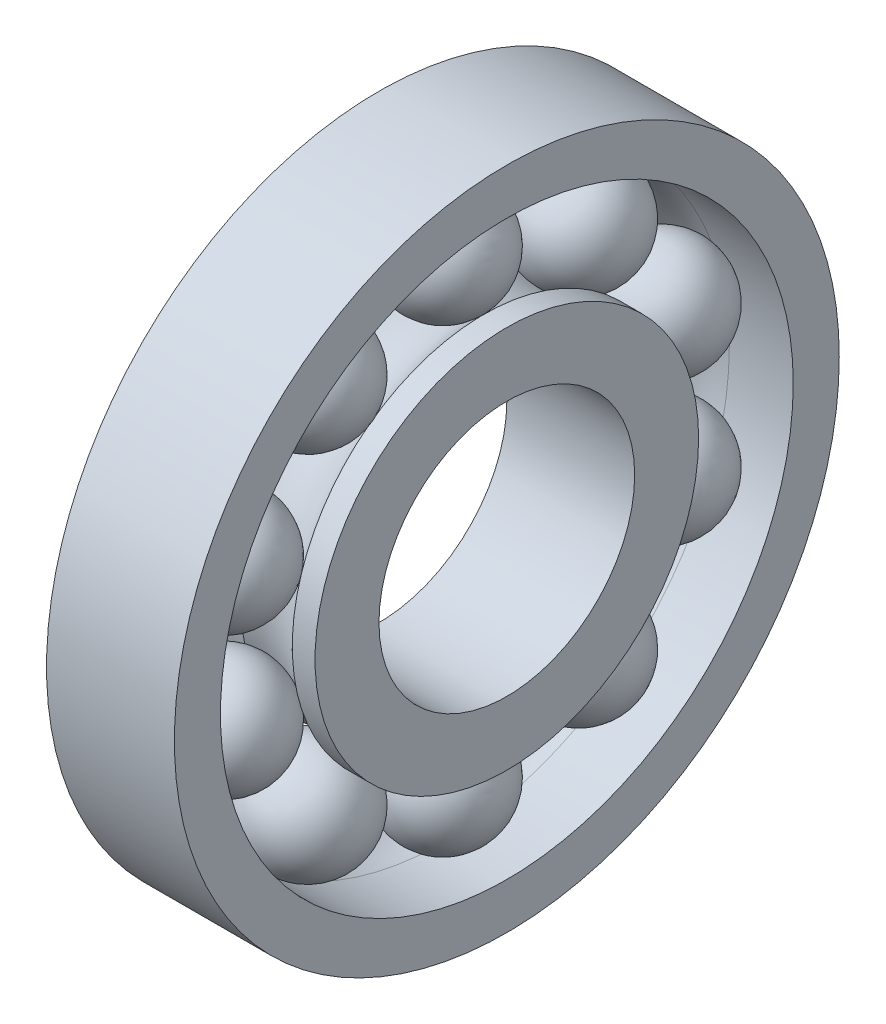
ISO-10303-21;
HEADER;
FILE_DESCRIPTION(('STEP AP214'),'2;1');
FILE_NAME('part.step','',(''),(''),'','','');
FILE_SCHEMA(('AUTOMOTIVE_DESIGN { 1 0 10303 214 1 1 1 1 }'));
ENDSEC;
DATA;
#1=APPLICATION_CONTEXT('core data for automotive mechanical design processes');
#2=APPLICATION_PROTOCOL_DEFINITION('international standard','automotive_design',2000,#1);
#3=PRODUCT_CONTEXT('',#1,'mechanical');
#4=PRODUCT('Part','Part','',(#3));
#5=PRODUCT_RELATED_PRODUCT_CATEGORY('part','',(#4));
#6=PRODUCT_DEFINITION_FORMATION('','',#4);
#7=PRODUCT_DEFINITION_CONTEXT('part definition',#1,'design');
#8=PRODUCT_DEFINITION('design','',#6,#7);
#9=PRODUCT_DEFINITION_SHAPE('','',#8);
#10=(LENGTH_UNIT() NAMED_UNIT(*) SI_UNIT(.MILLI.,.METRE.));
#11=(NAMED_UNIT(*) PLANE_ANGLE_UNIT() SI_UNIT($,.RADIAN.));
#12=(NAMED_UNIT(*) SI_UNIT($,.STERADIAN.) SOLID_ANGLE_UNIT());
#13=UNCERTAINTY_MEASURE_WITH_UNIT(LENGTH_MEASURE(1.E-05),#10,'distance_accuracy_value','');
#14=(GEOMETRIC_REPRESENTATION_CONTEXT(3) GLOBAL_UNCERTAINTY_ASSIGNED_CONTEXT((#13)) GLOBAL_UNIT_ASSIGNED_CONTEXT((#10,
#11,#12)) REPRESENTATION_CONTEXT('',''));
#15=CARTESIAN_POINT('',(0.,0.,0.));
#16=DIRECTION('',(0.,0.,1.));
#17=DIRECTION('',(1.,0.,0.));
#18=AXIS2_PLACEMENT_3D('',#15,#16,#17);
#19=CARTESIAN_POINT('',(2.5,7.2811529493746,-5.29006727063216));
#20=DIRECTION('',(0.,0.809016994374955,-0.587785252292462));
#21=DIRECTION('',(1.,0.,0.));
#22=AXIS2_PLACEMENT_3D('',#19,#20,#21);
#23=SPHERICAL_SURFACE('',#22,2.20000238775811);
#24=CARTESIAN_POINT('',(2.5,9.06099226873638,-6.58319622916458));
#25=VERTEX_POINT('',#24);
#26=VERTEX_LOOP('',#25);
#27=FACE_BOUND('',#26,.T.);
#28=ADVANCED_FACE('F50',(#27),#23,.T.);
#29=CLOSED_SHELL('',(#28));
#30=MANIFOLD_SOLID_BREP('B2',#29);
#31=CARTESIAN_POINT('',(2.5,2.78115294937462,-8.55950864665635));
#32=DIRECTION('',(0.,0.309016994374958,-0.95105651629515));
#33=DIRECTION('',(1.,0.,0.));
#34=AXIS2_PLACEMENT_3D('',#31,#32,#33);
#35=SPHERICAL_SURFACE('',#34,2.20000238775811);
#36=CARTESIAN_POINT('',(2.5,3.46099107485737,-10.6518352533986));
#37=VERTEX_POINT('',#36);
#38=VERTEX_LOOP('',#37);
#39=FACE_BOUND('',#38,.T.);
#40=ADVANCED_FACE('F71',(#39),#35,.T.);
#41=CLOSED_SHELL('',(#40));
#42=MANIFOLD_SOLID_BREP('B6',#41);
#43=CARTESIAN_POINT('',(2.5,-2.78115294937444,-8.55950864665641));
#44=DIRECTION('',(0.,-0.309016994374938,-0.951056516295157));
#45=DIRECTION('',(1.,0.,0.));
#46=AXIS2_PLACEMENT_3D('',#43,#44,#45);
#47=SPHERICAL_SURFACE('',#46,2.20000238775811);
#48=CARTESIAN_POINT('',(2.5,-3.46099107485714,-10.6518352533987));
#49=VERTEX_POINT('',#48);
#50=VERTEX_LOOP('',#49);
#51=FACE_BOUND('',#50,.T.);
#52=ADVANCED_FACE('F92',(#51),#47,.T.);
#53=CLOSED_SHELL('',(#52));
#54=MANIFOLD_SOLID_BREP('B46',#53);
#55=CARTESIAN_POINT('',(2.5,-7.28115294937448,-5.29006727063232));
#56=DIRECTION('',(0.,-0.809016994374942,-0.58778525229248));
#57=DIRECTION('',(1.,0.,0.));
#58=AXIS2_PLACEMENT_3D('',#55,#56,#57);
#59=SPHERICAL_SURFACE('',#58,2.20000238775811);
#60=CARTESIAN_POINT('',(2.5,-9.06099226873624,-6.58319622916478));
#61=VERTEX_POINT('',#60);
#62=VERTEX_LOOP('',#61);
#63=FACE_BOUND('',#62,.T.);
#64=ADVANCED_FACE('F113',(#63),#59,.T.);
#65=CLOSED_SHELL('',(#64));
#66=MANIFOLD_SOLID_BREP('B67',#65);
#67=CARTESIAN_POINT('',(2.5,-9.,0.));
#68=DIRECTION('',(0.,-1.,0.));
#69=DIRECTION('',(1.,0.,0.));
#70=AXIS2_PLACEMENT_3D('',#67,#68,#69);
#71=SPHERICAL_SURFACE('',#70,2.20000238775811);
#72=CARTESIAN_POINT('',(2.5,-11.2000023877581,0.));
#73=VERTEX_POINT('',#72);
#74=VERTEX_LOOP('',#73);
#75=FACE_BOUND('',#74,.T.);
#76=ADVANCED_FACE('F134',(#75),#71,.T.);
#77=CLOSED_SHELL('',(#76));
#78=MANIFOLD_SOLID_BREP('B88',#77);
#79=CARTESIAN_POINT('',(2.5,-7.28115294937456,5.29006727063222));
#80=DIRECTION('',(0.,-0.809016994374951,0.587785252292469));
#81=DIRECTION('',(1.,0.,0.));
#82=AXIS2_PLACEMENT_3D('',#79,#80,#81);
#83=SPHERICAL_SURFACE('',#82,2.20000238775811);
#84=CARTESIAN_POINT('',(2.5,-9.06099226873634,6.58319622916465));
#85=VERTEX_POINT('',#84);
#86=VERTEX_LOOP('',#85);
#87=FACE_BOUND('',#86,.T.);
#88=ADVANCED_FACE('F155',(#87),#83,.T.);
#89=CLOSED_SHELL('',(#88));
#90=MANIFOLD_SOLID_BREP('B109',#89);
#91=CARTESIAN_POINT('',(2.5,-2.78115294937456,8.55950864665637));
#92=DIRECTION('',(0.,-0.309016994374952,0.951056516295152));
#93=DIRECTION('',(1.,0.,0.));
#94=AXIS2_PLACEMENT_3D('',#91,#92,#93);
#95=SPHERICAL_SURFACE('',#94,2.20000238775811);
#96=CARTESIAN_POINT('',(2.5,-3.46099107485729,10.6518352533986));
#97=VERTEX_POINT('',#96);
#98=VERTEX_LOOP('',#97);
#99=FACE_BOUND('',#98,.T.);
#100=ADVANCED_FACE('F176',(#99),#95,.T.);
#101=CLOSED_SHELL('',(#100));
#102=MANIFOLD_SOLID_BREP('B130',#101);
#103=CARTESIAN_POINT('',(2.5,2.7811529493745,8.55950864665639));
#104=DIRECTION('',(0.,0.309016994374945,0.951056516295155));
#105=DIRECTION('',(1.,0.,0.));
#106=AXIS2_PLACEMENT_3D('',#103,#104,#105);
#107=SPHERICAL_SURFACE('',#106,2.20000238775811);
#108=CARTESIAN_POINT('',(2.5,3.46099107485722,10.6518352533986));
#109=VERTEX_POINT('',#108);
#110=VERTEX_LOOP('',#109);
#111=FACE_BOUND('',#110,.T.);
#112=ADVANCED_FACE('F197',(#111),#107,.T.);
#113=CLOSED_SHELL('',(#112));
#114=MANIFOLD_SOLID_BREP('B151',#113);
#115=CARTESIAN_POINT('',(2.5,7.28115294937452,5.29006727063227));
#116=DIRECTION('',(0.,0.809016994374947,0.587785252292474));
#117=DIRECTION('',(1.,0.,0.));
#118=AXIS2_PLACEMENT_3D('',#115,#116,#117);
#119=SPHERICAL_SURFACE('',#118,2.20000238775811);
#120=CARTESIAN_POINT('',(2.5,9.06099226873629,6.58319622916471));
#121=VERTEX_POINT('',#120);
#122=VERTEX_LOOP('',#121);
#123=FACE_BOUND('',#122,.T.);
#124=ADVANCED_FACE('F218',(#123),#119,.T.);
#125=CLOSED_SHELL('',(#124));
#126=MANIFOLD_SOLID_BREP('B172',#125);
#127=CARTESIAN_POINT('',(2.5,9.,0.));
#128=DIRECTION('',(0.,1.,0.));
#129=DIRECTION('',(1.,0.,0.));
#130=AXIS2_PLACEMENT_3D('',#127,#128,#129);
#131=SPHERICAL_SURFACE('',#130,2.20000238775811);
#132=CARTESIAN_POINT('',(2.5,11.2000023877581,0.));
#133=VERTEX_POINT('',#132);
#134=VERTEX_LOOP('',#133);
#135=FACE_BOUND('',#134,.T.);
#136=ADVANCED_FACE('F241',(#135),#131,.T.);
#137=CLOSED_SHELL('',(#136));
#138=MANIFOLD_SOLID_BREP('B193',#137);
#139=CARTESIAN_POINT('',(2.5,0.,0.));
#140=DIRECTION('',(1.,0.,0.));
#141=DIRECTION('',(0.,0.,-1.));
#142=AXIS2_PLACEMENT_3D('',#139,#140,#141);
#143=TOROIDAL_SURFACE('',#142,9.,2.20000238775811);
#144=CARTESIAN_POINT('',(4.1093509580391,0.,0.));
#145=DIRECTION('',(1.,0.,0.));
#146=DIRECTION('',(0.,0.,-1.));
#147=AXIS2_PLACEMENT_3D('',#144,#145,#146);
#148=CIRCLE('',#147,7.5);
#149=CARTESIAN_POINT('',(4.1093509580391,0.,-7.5));
#150=VERTEX_POINT('',#149);
#151=EDGE_CURVE('E285',#150,#150,#148,.T.);
#152=ORIENTED_EDGE('',*,*,#151,.F.);
#153=EDGE_LOOP('',(#152));
#154=FACE_BOUND('',#153,.T.);
#155=CARTESIAN_POINT('',(1.58347912945674,0.,0.));
#156=DIRECTION('',(1.,0.,0.));
#157=DIRECTION('',(0.,0.,-1.));
#158=AXIS2_PLACEMENT_3D('',#155,#156,#157);
#159=CIRCLE('',#158,7.);
#160=CARTESIAN_POINT('',(1.58347912945674,0.,-7.));
#161=VERTEX_POINT('',#160);
#162=EDGE_CURVE('E240',#161,#161,#159,.T.);
#163=ORIENTED_EDGE('',*,*,#162,.T.);
#164=EDGE_LOOP('',(#163));
#165=FACE_BOUND('',#164,.T.);
#166=ADVANCED_FACE('F263',(#154,#165),#143,.F.);
#167=CARTESIAN_POINT('',(88.99,0.,0.));
#168=DIRECTION('',(1.,0.,0.));
#169=DIRECTION('',(0.,0.,-1.));
#170=AXIS2_PLACEMENT_3D('',#167,#168,#169);
#171=CYLINDRICAL_SURFACE('',#170,7.);
#172=ORIENTED_EDGE('',*,*,#162,.F.);
#173=EDGE_LOOP('',(#172));
#174=FACE_BOUND('',#173,.T.);
#175=CARTESIAN_POINT('',(0.,0.,0.));
#176=DIRECTION('',(1.,0.,0.));
#177=DIRECTION('',(0.,0.,-1.));
#178=AXIS2_PLACEMENT_3D('',#175,#176,#177);
#179=CIRCLE('',#178,7.);
#180=CARTESIAN_POINT('',(0.,0.,-7.));
#181=VERTEX_POINT('',#180);
#182=EDGE_CURVE('E269',#181,#181,#179,.T.);
#183=ORIENTED_EDGE('',*,*,#182,.T.);
#184=EDGE_LOOP('',(#183));
#185=FACE_BOUND('',#184,.T.);
#186=ADVANCED_FACE('F292',(#174,#185),#171,.T.);
#187=CARTESIAN_POINT('',(0.,0.,0.));
#188=DIRECTION('',(-1.,0.,0.));
#189=DIRECTION('',(0.,0.,1.));
#190=AXIS2_PLACEMENT_3D('',#187,#188,#189);
#191=PLANE('',#190);
#192=CARTESIAN_POINT('',(0.,0.,0.));
#193=DIRECTION('',(1.,0.,0.));
#194=DIRECTION('',(0.,0.,-1.));
#195=AXIS2_PLACEMENT_3D('',#192,#193,#194);
#196=CIRCLE('',#195,5.);
#197=CARTESIAN_POINT('',(0.,0.,-5.));
#198=VERTEX_POINT('',#197);
#199=EDGE_CURVE('E273',#198,#198,#196,.T.);
#200=ORIENTED_EDGE('',*,*,#199,.T.);
#201=EDGE_LOOP('',(#200));
#202=FACE_BOUND('',#201,.T.);
#203=ORIENTED_EDGE('',*,*,#182,.F.);
#204=EDGE_LOOP('',(#203));
#205=FACE_BOUND('',#204,.T.);
#206=ADVANCED_FACE('F296',(#202,#205),#191,.T.);
#207=CARTESIAN_POINT('',(88.99,0.,0.));
#208=DIRECTION('',(1.,0.,0.));
#209=DIRECTION('',(0.,0.,-1.));
#210=AXIS2_PLACEMENT_3D('',#207,#208,#209);
#211=CYLINDRICAL_SURFACE('',#210,5.);
#212=CARTESIAN_POINT('',(5.,0.,0.));
#213=DIRECTION('',(1.,0.,0.));
#214=DIRECTION('',(0.,0.,-1.));
#215=AXIS2_PLACEMENT_3D('',#212,#213,#214);
#216=CIRCLE('',#215,5.);
#217=CARTESIAN_POINT('',(5.,0.,-5.));
#218=VERTEX_POINT('',#217);
#219=EDGE_CURVE('E277',#218,#218,#216,.T.);
#220=ORIENTED_EDGE('',*,*,#219,.T.);
#221=EDGE_LOOP('',(#220));
#222=FACE_BOUND('',#221,.T.);
#223=ORIENTED_EDGE('',*,*,#199,.F.);
#224=EDGE_LOOP('',(#223));
#225=FACE_BOUND('',#224,.T.);
#226=ADVANCED_FACE('F301',(#222,#225),#211,.F.);
#227=CARTESIAN_POINT('',(5.,0.,0.));
#228=DIRECTION('',(-1.,0.,0.));
#229=DIRECTION('',(0.,0.,1.));
#230=AXIS2_PLACEMENT_3D('',#227,#228,#229);
#231=PLANE('',#230);
#232=ORIENTED_EDGE('',*,*,#219,.F.);
#233=EDGE_LOOP('',(#232));
#234=FACE_BOUND('',#233,.T.);
#235=CARTESIAN_POINT('',(5.,0.,0.));
#236=DIRECTION('',(1.,0.,0.));
#237=DIRECTION('',(0.,0.,-1.));
#238=AXIS2_PLACEMENT_3D('',#235,#236,#237);
#239=CIRCLE('',#238,7.5);
#240=CARTESIAN_POINT('',(5.,0.,-7.5));
#241=VERTEX_POINT('',#240);
#242=EDGE_CURVE('E282',#241,#241,#239,.T.);
#243=ORIENTED_EDGE('',*,*,#242,.T.);
#244=EDGE_LOOP('',(#243));
#245=FACE_BOUND('',#244,.T.);
#246=ADVANCED_FACE('F307',(#234,#245),#231,.F.);
#247=CARTESIAN_POINT('',(88.99,0.,0.));
#248=DIRECTION('',(1.,0.,0.));
#249=DIRECTION('',(0.,0.,-1.));
#250=AXIS2_PLACEMENT_3D('',#247,#248,#249);
#251=CYLINDRICAL_SURFACE('',#250,7.5);
#252=ORIENTED_EDGE('',*,*,#242,.F.);
#253=EDGE_LOOP('',(#252));
#254=FACE_BOUND('',#253,.T.);
#255=ORIENTED_EDGE('',*,*,#151,.T.);
#256=EDGE_LOOP('',(#255));
#257=FACE_BOUND('',#256,.T.);
#258=ADVANCED_FACE('F289',(#254,#257),#251,.T.);
#259=CLOSED_SHELL('',(#166,#186,#206,#226,#246,#258));
#260=MANIFOLD_SOLID_BREP('B214',#259);
#261=CARTESIAN_POINT('',(2.5,0.,0.));
#262=DIRECTION('',(1.,0.,0.));
#263=DIRECTION('',(0.,0.,-1.));
#264=AXIS2_PLACEMENT_3D('',#261,#262,#263);
#265=TOROIDAL_SURFACE('',#264,9.,2.20000238775811);
#266=CARTESIAN_POINT('',(0.8906490419609,0.,0.));
#267=DIRECTION('',(1.,0.,0.));
#268=DIRECTION('',(0.,0.,-1.));
#269=AXIS2_PLACEMENT_3D('',#266,#267,#268);
#270=CIRCLE('',#269,10.5);
#271=CARTESIAN_POINT('',(0.8906490419609,0.,-10.5));
#272=VERTEX_POINT('',#271);
#273=EDGE_CURVE('E394',#272,#272,#270,.T.);
#274=ORIENTED_EDGE('',*,*,#273,.F.);
#275=EDGE_LOOP('',(#274));
#276=FACE_BOUND('',#275,.T.);
#277=CARTESIAN_POINT('',(2.5,0.,0.));
#278=DIRECTION('',(1.,0.,0.));
#279=DIRECTION('',(0.,0.,-1.));
#280=AXIS2_PLACEMENT_3D('',#277,#278,#279);
#281=CIRCLE('',#280,11.2);
#282=CARTESIAN_POINT('',(2.5,0.,-11.2));
#283=VERTEX_POINT('',#282);
#284=EDGE_CURVE('E262',#283,#283,#281,.T.);
#285=ORIENTED_EDGE('',*,*,#284,.T.);
#286=EDGE_LOOP('',(#285));
#287=FACE_BOUND('',#286,.T.);
#288=ADVANCED_FACE('F367',(#276,#287),#265,.F.);
#289=CARTESIAN_POINT('',(88.99,0.,0.));
#290=DIRECTION('',(1.,0.,0.));
#291=DIRECTION('',(0.,0.,-1.));
#292=AXIS2_PLACEMENT_3D('',#289,#290,#291);
#293=CYLINDRICAL_SURFACE('',#292,11.2);
#294=CARTESIAN_POINT('',(5.,0.,0.));
#295=DIRECTION('',(1.,0.,0.));
#296=DIRECTION('',(0.,0.,-1.));
#297=AXIS2_PLACEMENT_3D('',#294,#295,#296);
#298=CIRCLE('',#297,11.2);
#299=CARTESIAN_POINT('',(5.,0.,-11.2));
#300=VERTEX_POINT('',#299);
#301=EDGE_CURVE('E374',#300,#300,#298,.T.);
#302=ORIENTED_EDGE('',*,*,#301,.T.);
#303=EDGE_LOOP('',(#302));
#304=FACE_BOUND('',#303,.T.);
#305=ORIENTED_EDGE('',*,*,#284,.F.);
#306=EDGE_LOOP('',(#305));
#307=FACE_BOUND('',#306,.T.);
#308=ADVANCED_FACE('F403',(#304,#307),#293,.F.);
#309=CARTESIAN_POINT('',(5.,0.,0.));
#310=DIRECTION('',(-1.,0.,0.));
#311=DIRECTION('',(0.,0.,1.));
#312=AXIS2_PLACEMENT_3D('',#309,#310,#311);
#313=PLANE('',#312);
#314=ORIENTED_EDGE('',*,*,#301,.F.);
#315=EDGE_LOOP('',(#314));
#316=FACE_BOUND('',#315,.T.);
#317=CARTESIAN_POINT('',(5.,0.,0.));
#318=DIRECTION('',(1.,0.,0.));
#319=DIRECTION('',(0.,0.,-1.));
#320=AXIS2_PLACEMENT_3D('',#317,#318,#319);
#321=CIRCLE('',#320,13.);
#322=CARTESIAN_POINT('',(5.,0.,-13.));
#323=VERTEX_POINT('',#322);
#324=EDGE_CURVE('E379',#323,#323,#321,.T.);
#325=ORIENTED_EDGE('',*,*,#324,.T.);
#326=EDGE_LOOP('',(#325));
#327=FACE_BOUND('',#326,.T.);
#328=ADVANCED_FACE('F407',(#316,#327),#313,.F.);
#329=CARTESIAN_POINT('',(88.99,0.,0.));
#330=DIRECTION('',(1.,0.,0.));
#331=DIRECTION('',(0.,0.,-1.));
#332=AXIS2_PLACEMENT_3D('',#329,#330,#331);
#333=CYLINDRICAL_SURFACE('',#332,13.);
#334=ORIENTED_EDGE('',*,*,#324,.F.);
#335=EDGE_LOOP('',(#334));
#336=FACE_BOUND('',#335,.T.);
#337=CARTESIAN_POINT('',(0.,0.,0.));
#338=DIRECTION('',(1.,0.,0.));
#339=DIRECTION('',(0.,0.,-1.));
#340=AXIS2_PLACEMENT_3D('',#337,#338,#339);
#341=CIRCLE('',#340,13.);
#342=CARTESIAN_POINT('',(0.,0.,-13.));
#343=VERTEX_POINT('',#342);
#344=EDGE_CURVE('E384',#343,#343,#341,.T.);
#345=ORIENTED_EDGE('',*,*,#344,.T.);
#346=EDGE_LOOP('',(#345));
#347=FACE_BOUND('',#346,.T.);
#348=ADVANCED_FACE('F411',(#336,#347),#333,.T.);
#349=CARTESIAN_POINT('',(0.,0.,0.));
#350=DIRECTION('',(-1.,0.,0.));
#351=DIRECTION('',(0.,0.,1.));
#352=AXIS2_PLACEMENT_3D('',#349,#350,#351);
#353=PLANE('',#352);
#354=CARTESIAN_POINT('',(0.,0.,0.));
#355=DIRECTION('',(1.,0.,0.));
#356=DIRECTION('',(0.,0.,-1.));
#357=AXIS2_PLACEMENT_3D('',#354,#355,#356);
#358=CIRCLE('',#357,10.5);
#359=CARTESIAN_POINT('',(0.,0.,-10.5));
#360=VERTEX_POINT('',#359);
#361=EDGE_CURVE('E390',#360,#360,#358,.T.);
#362=ORIENTED_EDGE('',*,*,#361,.T.);
#363=EDGE_LOOP('',(#362));
#364=FACE_BOUND('',#363,.T.);
#365=ORIENTED_EDGE('',*,*,#344,.F.);
#366=EDGE_LOOP('',(#365));
#367=FACE_BOUND('',#366,.T.);
#368=ADVANCED_FACE('F418',(#364,#367),#353,.T.);
#369=CARTESIAN_POINT('',(88.99,0.,0.));
#370=DIRECTION('',(1.,0.,0.));
#371=DIRECTION('',(0.,0.,-1.));
#372=AXIS2_PLACEMENT_3D('',#369,#370,#371);
#373=CYLINDRICAL_SURFACE('',#372,10.5);
#374=ORIENTED_EDGE('',*,*,#273,.T.);
#375=EDGE_LOOP('',(#374));
#376=FACE_BOUND('',#375,.T.);
#377=ORIENTED_EDGE('',*,*,#361,.F.);
#378=EDGE_LOOP('',(#377));
#379=FACE_BOUND('',#378,.T.);
#380=ADVANCED_FACE('F399',(#376,#379),#373,.F.);
#381=CLOSED_SHELL('',(#288,#308,#328,#348,#368,#380));
#382=MANIFOLD_SOLID_BREP('B235',#381);
#383=ADVANCED_BREP_SHAPE_REPRESENTATION('',(#18,#30,#42,#54,#66,#78,#90,#102,#114,#126,#138,
#260,#382),#14);
#384=SHAPE_DEFINITION_REPRESENTATION(#9,#383);
ENDSEC;
END-ISO-10303-21;
